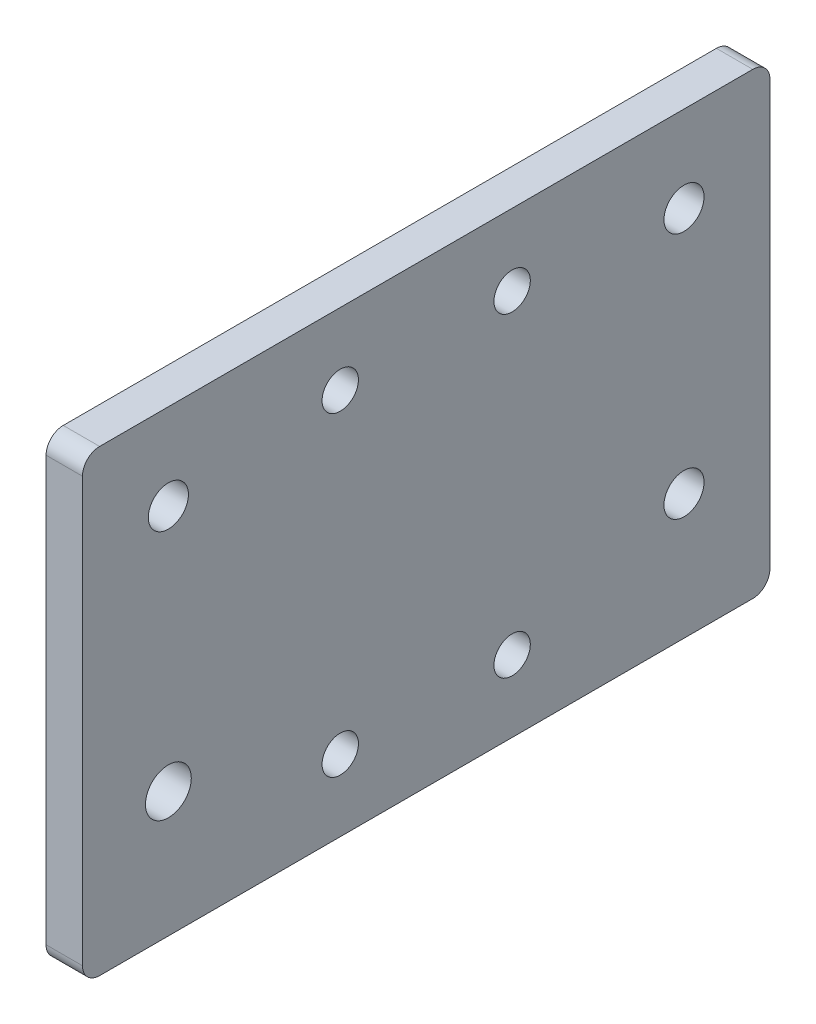
ISO-10303-21;
HEADER;
FILE_DESCRIPTION(('STEP AP214'),'2;1');
FILE_NAME('part.step','',(''),(''),'','','');
FILE_SCHEMA(('AUTOMOTIVE_DESIGN { 1 0 10303 214 1 1 1 1 }'));
ENDSEC;
DATA;
#1=APPLICATION_CONTEXT('core data for automotive mechanical design processes');
#2=APPLICATION_PROTOCOL_DEFINITION('international standard','automotive_design',2000,#1);
#3=PRODUCT_CONTEXT('',#1,'mechanical');
#4=PRODUCT('Part','Part','',(#3));
#5=PRODUCT_RELATED_PRODUCT_CATEGORY('part','',(#4));
#6=PRODUCT_DEFINITION_FORMATION('','',#4);
#7=PRODUCT_DEFINITION_CONTEXT('part definition',#1,'design');
#8=PRODUCT_DEFINITION('design','',#6,#7);
#9=PRODUCT_DEFINITION_SHAPE('','',#8);
#10=(LENGTH_UNIT() NAMED_UNIT(*) SI_UNIT(.MILLI.,.METRE.));
#11=(NAMED_UNIT(*) PLANE_ANGLE_UNIT() SI_UNIT($,.RADIAN.));
#12=(NAMED_UNIT(*) SI_UNIT($,.STERADIAN.) SOLID_ANGLE_UNIT());
#13=UNCERTAINTY_MEASURE_WITH_UNIT(LENGTH_MEASURE(1.E-05),#10,'distance_accuracy_value','');
#14=(GEOMETRIC_REPRESENTATION_CONTEXT(3) GLOBAL_UNCERTAINTY_ASSIGNED_CONTEXT((#13)) GLOBAL_UNIT_ASSIGNED_CONTEXT((#10,
#11,#12)) REPRESENTATION_CONTEXT('',''));
#15=CARTESIAN_POINT('',(0.,0.,0.));
#16=DIRECTION('',(0.,0.,1.));
#17=DIRECTION('',(1.,0.,0.));
#18=AXIS2_PLACEMENT_3D('',#15,#16,#17);
#19=CARTESIAN_POINT('',(6.35,0.,0.));
#20=DIRECTION('',(-1.,0.,0.));
#21=DIRECTION('',(0.,0.,1.));
#22=AXIS2_PLACEMENT_3D('',#19,#20,#21);
#23=PLANE('',#22);
#24=CARTESIAN_POINT('',(6.35,-27.5,15.));
#25=DIRECTION('',(1.,0.,0.));
#26=DIRECTION('',(0.,0.,-1.));
#27=AXIS2_PLACEMENT_3D('',#24,#25,#26);
#28=CIRCLE('',#27,3.175);
#29=CARTESIAN_POINT('',(6.35,-27.5,11.825));
#30=VERTEX_POINT('',#29);
#31=EDGE_CURVE('E407',#30,#30,#28,.T.);
#32=ORIENTED_EDGE('',*,*,#31,.F.);
#33=EDGE_LOOP('',(#32));
#34=FACE_BOUND('',#33,.T.);
#35=CARTESIAN_POINT('',(6.35,-27.5,-15.));
#36=DIRECTION('',(1.,0.,0.));
#37=DIRECTION('',(0.,0.,-1.));
#38=AXIS2_PLACEMENT_3D('',#35,#36,#37);
#39=CIRCLE('',#38,3.175);
#40=CARTESIAN_POINT('',(6.35,-27.5,-18.175));
#41=VERTEX_POINT('',#40);
#42=EDGE_CURVE('E408',#41,#41,#39,.T.);
#43=ORIENTED_EDGE('',*,*,#42,.F.);
#44=EDGE_LOOP('',(#43));
#45=FACE_BOUND('',#44,.T.);
#46=CARTESIAN_POINT('',(6.35,27.5,-15.));
#47=DIRECTION('',(1.,0.,0.));
#48=DIRECTION('',(0.,0.,-1.));
#49=AXIS2_PLACEMENT_3D('',#46,#47,#48);
#50=CIRCLE('',#49,3.175);
#51=CARTESIAN_POINT('',(6.35,27.5,-18.175));
#52=VERTEX_POINT('',#51);
#53=EDGE_CURVE('E411',#52,#52,#50,.T.);
#54=ORIENTED_EDGE('',*,*,#53,.F.);
#55=EDGE_LOOP('',(#54));
#56=FACE_BOUND('',#55,.T.);
#57=CARTESIAN_POINT('',(6.35,27.5,15.));
#58=DIRECTION('',(1.,0.,0.));
#59=DIRECTION('',(0.,0.,-1.));
#60=AXIS2_PLACEMENT_3D('',#57,#58,#59);
#61=CIRCLE('',#60,3.175);
#62=CARTESIAN_POINT('',(6.35,27.5,11.825));
#63=VERTEX_POINT('',#62);
#64=EDGE_CURVE('E172',#63,#63,#61,.T.);
#65=ORIENTED_EDGE('',*,*,#64,.F.);
#66=EDGE_LOOP('',(#65));
#67=FACE_BOUND('',#66,.T.);
#68=DIRECTION('',(0.,0.,-1.));
#69=VECTOR('',#68,1.);
#70=CARTESIAN_POINT('',(6.35,-40.,60.));
#71=LINE('',#70,#69);
#72=CARTESIAN_POINT('',(6.35,-40.,57.));
#73=VERTEX_POINT('',#72);
#74=CARTESIAN_POINT('',(6.35,-40.,-57.));
#75=VERTEX_POINT('',#74);
#76=EDGE_CURVE('E141',#73,#75,#71,.T.);
#77=ORIENTED_EDGE('',*,*,#76,.T.);
#78=CARTESIAN_POINT('',(6.35,-37.,-57.));
#79=DIRECTION('',(-1.,0.,0.));
#80=DIRECTION('',(0.,0.,1.));
#81=AXIS2_PLACEMENT_3D('',#78,#79,#80);
#82=CIRCLE('',#81,3.);
#83=CARTESIAN_POINT('',(6.35,-37.,-60.));
#84=VERTEX_POINT('',#83);
#85=EDGE_CURVE('E160',#75,#84,#82,.F.);
#86=ORIENTED_EDGE('',*,*,#85,.T.);
#87=DIRECTION('',(0.,1.,0.));
#88=VECTOR('',#87,1.);
#89=CARTESIAN_POINT('',(6.35,-40.,-60.));
#90=LINE('',#89,#88);
#91=CARTESIAN_POINT('',(6.35,37.,-60.));
#92=VERTEX_POINT('',#91);
#93=EDGE_CURVE('E124',#84,#92,#90,.T.);
#94=ORIENTED_EDGE('',*,*,#93,.T.);
#95=CARTESIAN_POINT('',(6.35,37.,-57.));
#96=DIRECTION('',(-1.,0.,0.));
#97=DIRECTION('',(0.,0.,1.));
#98=AXIS2_PLACEMENT_3D('',#95,#96,#97);
#99=CIRCLE('',#98,3.);
#100=CARTESIAN_POINT('',(6.35,40.,-57.));
#101=VERTEX_POINT('',#100);
#102=EDGE_CURVE('E155',#92,#101,#99,.F.);
#103=ORIENTED_EDGE('',*,*,#102,.T.);
#104=DIRECTION('',(0.,0.,1.));
#105=VECTOR('',#104,1.);
#106=CARTESIAN_POINT('',(6.35,40.,60.));
#107=LINE('',#106,#105);
#108=CARTESIAN_POINT('',(6.35,40.,57.));
#109=VERTEX_POINT('',#108);
#110=EDGE_CURVE('E206',#101,#109,#107,.T.);
#111=ORIENTED_EDGE('',*,*,#110,.T.);
#112=CARTESIAN_POINT('',(6.35,37.,57.));
#113=DIRECTION('',(-1.,0.,0.));
#114=DIRECTION('',(0.,0.,1.));
#115=AXIS2_PLACEMENT_3D('',#112,#113,#114);
#116=CIRCLE('',#115,3.);
#117=CARTESIAN_POINT('',(6.35,37.,60.));
#118=VERTEX_POINT('',#117);
#119=EDGE_CURVE('E60',#109,#118,#116,.F.);
#120=ORIENTED_EDGE('',*,*,#119,.T.);
#121=DIRECTION('',(0.,-1.,0.));
#122=VECTOR('',#121,1.);
#123=CARTESIAN_POINT('',(6.35,-40.,60.));
#124=LINE('',#123,#122);
#125=CARTESIAN_POINT('',(6.35,-37.,60.));
#126=VERTEX_POINT('',#125);
#127=EDGE_CURVE('E207',#118,#126,#124,.T.);
#128=ORIENTED_EDGE('',*,*,#127,.T.);
#129=CARTESIAN_POINT('',(6.35,-37.,57.));
#130=DIRECTION('',(-1.,0.,0.));
#131=DIRECTION('',(0.,0.,1.));
#132=AXIS2_PLACEMENT_3D('',#129,#130,#131);
#133=CIRCLE('',#132,3.);
#134=EDGE_CURVE('E158',#126,#73,#133,.F.);
#135=ORIENTED_EDGE('',*,*,#134,.T.);
#136=EDGE_LOOP('',(#77,#86,#94,#103,#111,#120,#128,#135));
#137=FACE_BOUND('',#136,.T.);
#138=CARTESIAN_POINT('',(6.35,25.,-45.));
#139=DIRECTION('',(1.,0.,0.));
#140=DIRECTION('',(0.,0.,-1.));
#141=AXIS2_PLACEMENT_3D('',#138,#139,#140);
#142=CIRCLE('',#141,3.50000000000002);
#143=CARTESIAN_POINT('',(6.35,25.,-48.5));
#144=VERTEX_POINT('',#143);
#145=EDGE_CURVE('E132',#144,#144,#142,.T.);
#146=ORIENTED_EDGE('',*,*,#145,.F.);
#147=EDGE_LOOP('',(#146));
#148=FACE_BOUND('',#147,.T.);
#149=CARTESIAN_POINT('',(6.35,25.,45.));
#150=DIRECTION('',(1.,0.,0.));
#151=DIRECTION('',(0.,0.,-1.));
#152=AXIS2_PLACEMENT_3D('',#149,#150,#151);
#153=CIRCLE('',#152,3.5);
#154=CARTESIAN_POINT('',(6.35,25.,41.5));
#155=VERTEX_POINT('',#154);
#156=EDGE_CURVE('E198',#155,#155,#153,.T.);
#157=ORIENTED_EDGE('',*,*,#156,.F.);
#158=EDGE_LOOP('',(#157));
#159=FACE_BOUND('',#158,.T.);
#160=CARTESIAN_POINT('',(6.35,-18.13,45.));
#161=DIRECTION('',(1.,0.,0.));
#162=DIRECTION('',(0.,0.,-1.));
#163=AXIS2_PLACEMENT_3D('',#160,#161,#162);
#164=CIRCLE('',#163,4.);
#165=CARTESIAN_POINT('',(6.35,-18.13,41.));
#166=VERTEX_POINT('',#165);
#167=EDGE_CURVE('E192',#166,#166,#164,.T.);
#168=ORIENTED_EDGE('',*,*,#167,.F.);
#169=EDGE_LOOP('',(#168));
#170=FACE_BOUND('',#169,.T.);
#171=CARTESIAN_POINT('',(6.35,-18.13,-45.));
#172=DIRECTION('',(1.,0.,0.));
#173=DIRECTION('',(0.,0.,-1.));
#174=AXIS2_PLACEMENT_3D('',#171,#172,#173);
#175=CIRCLE('',#174,3.50000000000001);
#176=CARTESIAN_POINT('',(6.35,-18.13,-48.5));
#177=VERTEX_POINT('',#176);
#178=EDGE_CURVE('E183',#177,#177,#175,.T.);
#179=ORIENTED_EDGE('',*,*,#178,.F.);
#180=EDGE_LOOP('',(#179));
#181=FACE_BOUND('',#180,.T.);
#182=ADVANCED_FACE('F36',(#34,#45,#56,#67,#137,#148,#159,#170,#181),#23,.F.);
#183=CARTESIAN_POINT('',(0.,0.,0.));
#184=DIRECTION('',(-1.,0.,0.));
#185=DIRECTION('',(0.,0.,1.));
#186=AXIS2_PLACEMENT_3D('',#183,#184,#185);
#187=PLANE('',#186);
#188=CARTESIAN_POINT('',(0.,-27.5,15.));
#189=DIRECTION('',(-1.,0.,0.));
#190=DIRECTION('',(0.,0.,1.));
#191=AXIS2_PLACEMENT_3D('',#188,#189,#190);
#192=CIRCLE('',#191,3.175);
#193=CARTESIAN_POINT('',(0.,-27.5,18.175));
#194=VERTEX_POINT('',#193);
#195=EDGE_CURVE('E40',#194,#194,#192,.T.);
#196=ORIENTED_EDGE('',*,*,#195,.F.);
#197=EDGE_LOOP('',(#196));
#198=FACE_BOUND('',#197,.T.);
#199=CARTESIAN_POINT('',(0.,-27.5,-15.));
#200=DIRECTION('',(-1.,0.,0.));
#201=DIRECTION('',(0.,0.,1.));
#202=AXIS2_PLACEMENT_3D('',#199,#200,#201);
#203=CIRCLE('',#202,3.175);
#204=CARTESIAN_POINT('',(0.,-27.5,-11.825));
#205=VERTEX_POINT('',#204);
#206=EDGE_CURVE('E174',#205,#205,#203,.T.);
#207=ORIENTED_EDGE('',*,*,#206,.F.);
#208=EDGE_LOOP('',(#207));
#209=FACE_BOUND('',#208,.T.);
#210=CARTESIAN_POINT('',(0.,27.5,-15.));
#211=DIRECTION('',(-1.,0.,0.));
#212=DIRECTION('',(0.,0.,1.));
#213=AXIS2_PLACEMENT_3D('',#210,#211,#212);
#214=CIRCLE('',#213,3.175);
#215=CARTESIAN_POINT('',(0.,27.5,-11.825));
#216=VERTEX_POINT('',#215);
#217=EDGE_CURVE('E171',#216,#216,#214,.T.);
#218=ORIENTED_EDGE('',*,*,#217,.F.);
#219=EDGE_LOOP('',(#218));
#220=FACE_BOUND('',#219,.T.);
#221=CARTESIAN_POINT('',(0.,27.5,15.));
#222=DIRECTION('',(-1.,0.,0.));
#223=DIRECTION('',(0.,0.,1.));
#224=AXIS2_PLACEMENT_3D('',#221,#222,#223);
#225=CIRCLE('',#224,3.175);
#226=CARTESIAN_POINT('',(0.,27.5,18.175));
#227=VERTEX_POINT('',#226);
#228=EDGE_CURVE('E168',#227,#227,#225,.T.);
#229=ORIENTED_EDGE('',*,*,#228,.F.);
#230=EDGE_LOOP('',(#229));
#231=FACE_BOUND('',#230,.T.);
#232=CARTESIAN_POINT('',(0.,-18.13,45.));
#233=DIRECTION('',(1.,0.,0.));
#234=DIRECTION('',(0.,0.,-1.));
#235=AXIS2_PLACEMENT_3D('',#232,#233,#234);
#236=CIRCLE('',#235,4.);
#237=CARTESIAN_POINT('',(0.,-18.13,41.));
#238=VERTEX_POINT('',#237);
#239=EDGE_CURVE('E188',#238,#238,#236,.T.);
#240=ORIENTED_EDGE('',*,*,#239,.T.);
#241=EDGE_LOOP('',(#240));
#242=FACE_BOUND('',#241,.T.);
#243=CARTESIAN_POINT('',(0.,25.,-45.));
#244=DIRECTION('',(1.,0.,0.));
#245=DIRECTION('',(0.,0.,-1.));
#246=AXIS2_PLACEMENT_3D('',#243,#244,#245);
#247=CIRCLE('',#246,3.50000000000002);
#248=CARTESIAN_POINT('',(0.,25.,-48.5));
#249=VERTEX_POINT('',#248);
#250=EDGE_CURVE('E138',#249,#249,#247,.T.);
#251=ORIENTED_EDGE('',*,*,#250,.T.);
#252=EDGE_LOOP('',(#251));
#253=FACE_BOUND('',#252,.T.);
#254=DIRECTION('',(0.,1.,0.));
#255=VECTOR('',#254,1.);
#256=CARTESIAN_POINT('',(0.,-40.,-60.));
#257=LINE('',#256,#255);
#258=CARTESIAN_POINT('',(0.,-37.,-60.));
#259=VERTEX_POINT('',#258);
#260=CARTESIAN_POINT('',(0.,37.,-60.));
#261=VERTEX_POINT('',#260);
#262=EDGE_CURVE('E121',#259,#261,#257,.T.);
#263=ORIENTED_EDGE('',*,*,#262,.F.);
#264=CARTESIAN_POINT('',(0.,-37.,-57.));
#265=DIRECTION('',(-1.,0.,0.));
#266=DIRECTION('',(0.,0.,1.));
#267=AXIS2_PLACEMENT_3D('',#264,#265,#266);
#268=CIRCLE('',#267,3.);
#269=CARTESIAN_POINT('',(0.,-40.,-57.));
#270=VERTEX_POINT('',#269);
#271=EDGE_CURVE('E104',#259,#270,#268,.T.);
#272=ORIENTED_EDGE('',*,*,#271,.T.);
#273=DIRECTION('',(0.,0.,-1.));
#274=VECTOR('',#273,1.);
#275=CARTESIAN_POINT('',(0.,-40.,60.));
#276=LINE('',#275,#274);
#277=CARTESIAN_POINT('',(0.,-40.,57.));
#278=VERTEX_POINT('',#277);
#279=EDGE_CURVE('E145',#278,#270,#276,.T.);
#280=ORIENTED_EDGE('',*,*,#279,.F.);
#281=CARTESIAN_POINT('',(0.,-37.,57.));
#282=DIRECTION('',(-1.,0.,0.));
#283=DIRECTION('',(0.,0.,1.));
#284=AXIS2_PLACEMENT_3D('',#281,#282,#283);
#285=CIRCLE('',#284,3.);
#286=CARTESIAN_POINT('',(0.,-37.,60.));
#287=VERTEX_POINT('',#286);
#288=EDGE_CURVE('E115',#278,#287,#285,.T.);
#289=ORIENTED_EDGE('',*,*,#288,.T.);
#290=DIRECTION('',(0.,-1.,0.));
#291=VECTOR('',#290,1.);
#292=CARTESIAN_POINT('',(0.,-40.,60.));
#293=LINE('',#292,#291);
#294=CARTESIAN_POINT('',(0.,37.,60.));
#295=VERTEX_POINT('',#294);
#296=EDGE_CURVE('E135',#295,#287,#293,.T.);
#297=ORIENTED_EDGE('',*,*,#296,.F.);
#298=CARTESIAN_POINT('',(0.,37.,57.));
#299=DIRECTION('',(-1.,0.,0.));
#300=DIRECTION('',(0.,0.,1.));
#301=AXIS2_PLACEMENT_3D('',#298,#299,#300);
#302=CIRCLE('',#301,3.);
#303=CARTESIAN_POINT('',(0.,40.,57.));
#304=VERTEX_POINT('',#303);
#305=EDGE_CURVE('E149',#295,#304,#302,.T.);
#306=ORIENTED_EDGE('',*,*,#305,.T.);
#307=DIRECTION('',(0.,0.,1.));
#308=VECTOR('',#307,1.);
#309=CARTESIAN_POINT('',(0.,40.,60.));
#310=LINE('',#309,#308);
#311=CARTESIAN_POINT('',(0.,40.,-57.));
#312=VERTEX_POINT('',#311);
#313=EDGE_CURVE('E131',#312,#304,#310,.T.);
#314=ORIENTED_EDGE('',*,*,#313,.F.);
#315=CARTESIAN_POINT('',(0.,37.,-57.));
#316=DIRECTION('',(-1.,0.,0.));
#317=DIRECTION('',(0.,0.,1.));
#318=AXIS2_PLACEMENT_3D('',#315,#316,#317);
#319=CIRCLE('',#318,3.);
#320=EDGE_CURVE('E125',#312,#261,#319,.T.);
#321=ORIENTED_EDGE('',*,*,#320,.T.);
#322=EDGE_LOOP('',(#263,#272,#280,#289,#297,#306,#314,#321));
#323=FACE_BOUND('',#322,.T.);
#324=CARTESIAN_POINT('',(0.,25.,45.));
#325=DIRECTION('',(1.,0.,0.));
#326=DIRECTION('',(0.,0.,-1.));
#327=AXIS2_PLACEMENT_3D('',#324,#325,#326);
#328=CIRCLE('',#327,3.5);
#329=CARTESIAN_POINT('',(0.,25.,41.5));
#330=VERTEX_POINT('',#329);
#331=EDGE_CURVE('E195',#330,#330,#328,.T.);
#332=ORIENTED_EDGE('',*,*,#331,.T.);
#333=EDGE_LOOP('',(#332));
#334=FACE_BOUND('',#333,.T.);
#335=CARTESIAN_POINT('',(0.,-18.13,-45.));
#336=DIRECTION('',(1.,0.,0.));
#337=DIRECTION('',(0.,0.,-1.));
#338=AXIS2_PLACEMENT_3D('',#335,#336,#337);
#339=CIRCLE('',#338,3.50000000000001);
#340=CARTESIAN_POINT('',(0.,-18.13,-48.5));
#341=VERTEX_POINT('',#340);
#342=EDGE_CURVE('E179',#341,#341,#339,.T.);
#343=ORIENTED_EDGE('',*,*,#342,.T.);
#344=EDGE_LOOP('',(#343));
#345=FACE_BOUND('',#344,.T.);
#346=ADVANCED_FACE('F128',(#198,#209,#220,#231,#242,#253,#323,#334,#345),#187,.T.);
#347=CARTESIAN_POINT('',(6.35,-40.,-60.));
#348=DIRECTION('',(0.,0.,1.));
#349=DIRECTION('',(1.,0.,0.));
#350=AXIS2_PLACEMENT_3D('',#347,#348,#349);
#351=PLANE('',#350);
#352=ORIENTED_EDGE('',*,*,#93,.F.);
#353=DIRECTION('',(-1.,0.,0.));
#354=VECTOR('',#353,1.);
#355=CARTESIAN_POINT('',(6.35,-37.,-60.));
#356=LINE('',#355,#354);
#357=EDGE_CURVE('E108',#84,#259,#356,.T.);
#358=ORIENTED_EDGE('',*,*,#357,.T.);
#359=ORIENTED_EDGE('',*,*,#262,.T.);
#360=DIRECTION('',(-1.,0.,0.));
#361=VECTOR('',#360,1.);
#362=CARTESIAN_POINT('',(6.35,37.,-60.));
#363=LINE('',#362,#361);
#364=EDGE_CURVE('E126',#261,#92,#363,.F.);
#365=ORIENTED_EDGE('',*,*,#364,.T.);
#366=EDGE_LOOP('',(#352,#358,#359,#365));
#367=FACE_BOUND('',#366,.T.);
#368=ADVANCED_FACE('F120',(#367),#351,.F.);
#369=CARTESIAN_POINT('',(6.35,40.,60.));
#370=DIRECTION('',(0.,-1.,0.));
#371=DIRECTION('',(0.,0.,-1.));
#372=AXIS2_PLACEMENT_3D('',#369,#370,#371);
#373=PLANE('',#372);
#374=ORIENTED_EDGE('',*,*,#313,.T.);
#375=DIRECTION('',(-1.,0.,0.));
#376=VECTOR('',#375,1.);
#377=CARTESIAN_POINT('',(6.35,40.,57.));
#378=LINE('',#377,#376);
#379=EDGE_CURVE('E11',#304,#109,#378,.F.);
#380=ORIENTED_EDGE('',*,*,#379,.T.);
#381=ORIENTED_EDGE('',*,*,#110,.F.);
#382=DIRECTION('',(-1.,0.,0.));
#383=VECTOR('',#382,1.);
#384=CARTESIAN_POINT('',(6.35,40.,-57.));
#385=LINE('',#384,#383);
#386=EDGE_CURVE('E45',#101,#312,#385,.T.);
#387=ORIENTED_EDGE('',*,*,#386,.T.);
#388=EDGE_LOOP('',(#374,#380,#381,#387));
#389=FACE_BOUND('',#388,.T.);
#390=ADVANCED_FACE('F224',(#389),#373,.F.);
#391=CARTESIAN_POINT('',(6.35,-40.,60.));
#392=DIRECTION('',(0.,0.,-1.));
#393=DIRECTION('',(0.,1.,0.));
#394=AXIS2_PLACEMENT_3D('',#391,#392,#393);
#395=PLANE('',#394);
#396=ORIENTED_EDGE('',*,*,#296,.T.);
#397=DIRECTION('',(-1.,0.,0.));
#398=VECTOR('',#397,1.);
#399=CARTESIAN_POINT('',(6.35,-37.,60.));
#400=LINE('',#399,#398);
#401=EDGE_CURVE('E53',#287,#126,#400,.F.);
#402=ORIENTED_EDGE('',*,*,#401,.T.);
#403=ORIENTED_EDGE('',*,*,#127,.F.);
#404=DIRECTION('',(-1.,0.,0.));
#405=VECTOR('',#404,1.);
#406=CARTESIAN_POINT('',(6.35,37.,60.));
#407=LINE('',#406,#405);
#408=EDGE_CURVE('E162',#118,#295,#407,.T.);
#409=ORIENTED_EDGE('',*,*,#408,.T.);
#410=EDGE_LOOP('',(#396,#402,#403,#409));
#411=FACE_BOUND('',#410,.T.);
#412=ADVANCED_FACE('F218',(#411),#395,.F.);
#413=CARTESIAN_POINT('',(6.35,-40.,60.));
#414=DIRECTION('',(0.,1.,0.));
#415=DIRECTION('',(0.,0.,1.));
#416=AXIS2_PLACEMENT_3D('',#413,#414,#415);
#417=PLANE('',#416);
#418=ORIENTED_EDGE('',*,*,#279,.T.);
#419=DIRECTION('',(-1.,0.,0.));
#420=VECTOR('',#419,1.);
#421=CARTESIAN_POINT('',(6.35,-40.,-57.));
#422=LINE('',#421,#420);
#423=EDGE_CURVE('E109',#270,#75,#422,.F.);
#424=ORIENTED_EDGE('',*,*,#423,.T.);
#425=ORIENTED_EDGE('',*,*,#76,.F.);
#426=DIRECTION('',(-1.,0.,0.));
#427=VECTOR('',#426,1.);
#428=CARTESIAN_POINT('',(6.35,-40.,57.));
#429=LINE('',#428,#427);
#430=EDGE_CURVE('E114',#73,#278,#429,.T.);
#431=ORIENTED_EDGE('',*,*,#430,.T.);
#432=EDGE_LOOP('',(#418,#424,#425,#431));
#433=FACE_BOUND('',#432,.T.);
#434=ADVANCED_FACE('F214',(#433),#417,.F.);
#435=CARTESIAN_POINT('',(6.35,25.,-45.));
#436=DIRECTION('',(-1.,0.,0.));
#437=DIRECTION('',(0.,0.,1.));
#438=AXIS2_PLACEMENT_3D('',#435,#436,#437);
#439=CYLINDRICAL_SURFACE('',#438,3.50000000000002);
#440=ORIENTED_EDGE('',*,*,#145,.T.);
#441=EDGE_LOOP('',(#440));
#442=FACE_BOUND('',#441,.T.);
#443=ORIENTED_EDGE('',*,*,#250,.F.);
#444=EDGE_LOOP('',(#443));
#445=FACE_BOUND('',#444,.T.);
#446=ADVANCED_FACE('F249',(#442,#445),#439,.F.);
#447=CARTESIAN_POINT('',(6.35,25.,45.));
#448=DIRECTION('',(-1.,0.,0.));
#449=DIRECTION('',(0.,0.,1.));
#450=AXIS2_PLACEMENT_3D('',#447,#448,#449);
#451=CYLINDRICAL_SURFACE('',#450,3.5);
#452=ORIENTED_EDGE('',*,*,#156,.T.);
#453=EDGE_LOOP('',(#452));
#454=FACE_BOUND('',#453,.T.);
#455=ORIENTED_EDGE('',*,*,#331,.F.);
#456=EDGE_LOOP('',(#455));
#457=FACE_BOUND('',#456,.T.);
#458=ADVANCED_FACE('F331',(#454,#457),#451,.F.);
#459=CARTESIAN_POINT('',(6.35,-18.13,45.));
#460=DIRECTION('',(-1.,0.,0.));
#461=DIRECTION('',(0.,0.,1.));
#462=AXIS2_PLACEMENT_3D('',#459,#460,#461);
#463=CYLINDRICAL_SURFACE('',#462,4.);
#464=ORIENTED_EDGE('',*,*,#167,.T.);
#465=EDGE_LOOP('',(#464));
#466=FACE_BOUND('',#465,.T.);
#467=ORIENTED_EDGE('',*,*,#239,.F.);
#468=EDGE_LOOP('',(#467));
#469=FACE_BOUND('',#468,.T.);
#470=ADVANCED_FACE('F328',(#466,#469),#463,.F.);
#471=CARTESIAN_POINT('',(6.35,-18.13,-45.));
#472=DIRECTION('',(-1.,0.,0.));
#473=DIRECTION('',(0.,0.,1.));
#474=AXIS2_PLACEMENT_3D('',#471,#472,#473);
#475=CYLINDRICAL_SURFACE('',#474,3.50000000000001);
#476=ORIENTED_EDGE('',*,*,#178,.T.);
#477=EDGE_LOOP('',(#476));
#478=FACE_BOUND('',#477,.T.);
#479=ORIENTED_EDGE('',*,*,#342,.F.);
#480=EDGE_LOOP('',(#479));
#481=FACE_BOUND('',#480,.T.);
#482=ADVANCED_FACE('F262',(#478,#481),#475,.F.);
#483=CARTESIAN_POINT('',(6.35,-37.,-57.));
#484=DIRECTION('',(-1.,0.,0.));
#485=DIRECTION('',(0.,0.,1.));
#486=AXIS2_PLACEMENT_3D('',#483,#484,#485);
#487=CYLINDRICAL_SURFACE('',#486,3.);
#488=ORIENTED_EDGE('',*,*,#85,.F.);
#489=ORIENTED_EDGE('',*,*,#423,.F.);
#490=ORIENTED_EDGE('',*,*,#271,.F.);
#491=ORIENTED_EDGE('',*,*,#357,.F.);
#492=EDGE_LOOP('',(#488,#489,#490,#491));
#493=FACE_BOUND('',#492,.T.);
#494=ADVANCED_FACE('F107',(#493),#487,.T.);
#495=CARTESIAN_POINT('',(6.35,-37.,57.));
#496=DIRECTION('',(-1.,0.,0.));
#497=DIRECTION('',(0.,0.,1.));
#498=AXIS2_PLACEMENT_3D('',#495,#496,#497);
#499=CYLINDRICAL_SURFACE('',#498,3.);
#500=ORIENTED_EDGE('',*,*,#134,.F.);
#501=ORIENTED_EDGE('',*,*,#401,.F.);
#502=ORIENTED_EDGE('',*,*,#288,.F.);
#503=ORIENTED_EDGE('',*,*,#430,.F.);
#504=EDGE_LOOP('',(#500,#501,#502,#503));
#505=FACE_BOUND('',#504,.T.);
#506=ADVANCED_FACE('F216',(#505),#499,.T.);
#507=CARTESIAN_POINT('',(6.35,37.,57.));
#508=DIRECTION('',(-1.,0.,0.));
#509=DIRECTION('',(0.,0.,1.));
#510=AXIS2_PLACEMENT_3D('',#507,#508,#509);
#511=CYLINDRICAL_SURFACE('',#510,3.);
#512=ORIENTED_EDGE('',*,*,#119,.F.);
#513=ORIENTED_EDGE('',*,*,#379,.F.);
#514=ORIENTED_EDGE('',*,*,#305,.F.);
#515=ORIENTED_EDGE('',*,*,#408,.F.);
#516=EDGE_LOOP('',(#512,#513,#514,#515));
#517=FACE_BOUND('',#516,.T.);
#518=ADVANCED_FACE('F221',(#517),#511,.T.);
#519=CARTESIAN_POINT('',(6.35,37.,-57.));
#520=DIRECTION('',(-1.,0.,0.));
#521=DIRECTION('',(0.,0.,1.));
#522=AXIS2_PLACEMENT_3D('',#519,#520,#521);
#523=CYLINDRICAL_SURFACE('',#522,3.);
#524=ORIENTED_EDGE('',*,*,#102,.F.);
#525=ORIENTED_EDGE('',*,*,#364,.F.);
#526=ORIENTED_EDGE('',*,*,#320,.F.);
#527=ORIENTED_EDGE('',*,*,#386,.F.);
#528=EDGE_LOOP('',(#524,#525,#526,#527));
#529=FACE_BOUND('',#528,.T.);
#530=ADVANCED_FACE('F38',(#529),#523,.T.);
#531=CARTESIAN_POINT('',(-3.65,27.5,15.));
#532=DIRECTION('',(1.,0.,0.));
#533=DIRECTION('',(0.,0.,-1.));
#534=AXIS2_PLACEMENT_3D('',#531,#532,#533);
#535=CYLINDRICAL_SURFACE('',#534,3.175);
#536=ORIENTED_EDGE('',*,*,#228,.T.);
#537=EDGE_LOOP('',(#536));
#538=FACE_BOUND('',#537,.T.);
#539=ORIENTED_EDGE('',*,*,#64,.T.);
#540=EDGE_LOOP('',(#539));
#541=FACE_BOUND('',#540,.T.);
#542=ADVANCED_FACE('F230',(#538,#541),#535,.F.);
#543=CARTESIAN_POINT('',(-3.65,27.5,-15.));
#544=DIRECTION('',(1.,0.,0.));
#545=DIRECTION('',(0.,0.,-1.));
#546=AXIS2_PLACEMENT_3D('',#543,#544,#545);
#547=CYLINDRICAL_SURFACE('',#546,3.175);
#548=ORIENTED_EDGE('',*,*,#217,.T.);
#549=EDGE_LOOP('',(#548));
#550=FACE_BOUND('',#549,.T.);
#551=ORIENTED_EDGE('',*,*,#53,.T.);
#552=EDGE_LOOP('',(#551));
#553=FACE_BOUND('',#552,.T.);
#554=ADVANCED_FACE('F235',(#550,#553),#547,.F.);
#555=CARTESIAN_POINT('',(-3.65,-27.5,-15.));
#556=DIRECTION('',(1.,0.,0.));
#557=DIRECTION('',(0.,0.,-1.));
#558=AXIS2_PLACEMENT_3D('',#555,#556,#557);
#559=CYLINDRICAL_SURFACE('',#558,3.175);
#560=ORIENTED_EDGE('',*,*,#206,.T.);
#561=EDGE_LOOP('',(#560));
#562=FACE_BOUND('',#561,.T.);
#563=ORIENTED_EDGE('',*,*,#42,.T.);
#564=EDGE_LOOP('',(#563));
#565=FACE_BOUND('',#564,.T.);
#566=ADVANCED_FACE('F303',(#562,#565),#559,.F.);
#567=CARTESIAN_POINT('',(-3.65,-27.5,15.));
#568=DIRECTION('',(1.,0.,0.));
#569=DIRECTION('',(0.,0.,-1.));
#570=AXIS2_PLACEMENT_3D('',#567,#568,#569);
#571=CYLINDRICAL_SURFACE('',#570,3.175);
#572=ORIENTED_EDGE('',*,*,#195,.T.);
#573=EDGE_LOOP('',(#572));
#574=FACE_BOUND('',#573,.T.);
#575=ORIENTED_EDGE('',*,*,#31,.T.);
#576=EDGE_LOOP('',(#575));
#577=FACE_BOUND('',#576,.T.);
#578=ADVANCED_FACE('F313',(#574,#577),#571,.F.);
#579=CLOSED_SHELL('',(#182,#346,#368,#390,#412,#434,#446,#458,#470,#482,#494,#506,#518,#530,
#542,#554,#566,#578));
#580=MANIFOLD_SOLID_BREP('B2',#579);
#581=ADVANCED_BREP_SHAPE_REPRESENTATION('',(#18,#580),#14);
#582=SHAPE_DEFINITION_REPRESENTATION(#9,#581);
ENDSEC;
END-ISO-10303-21;
